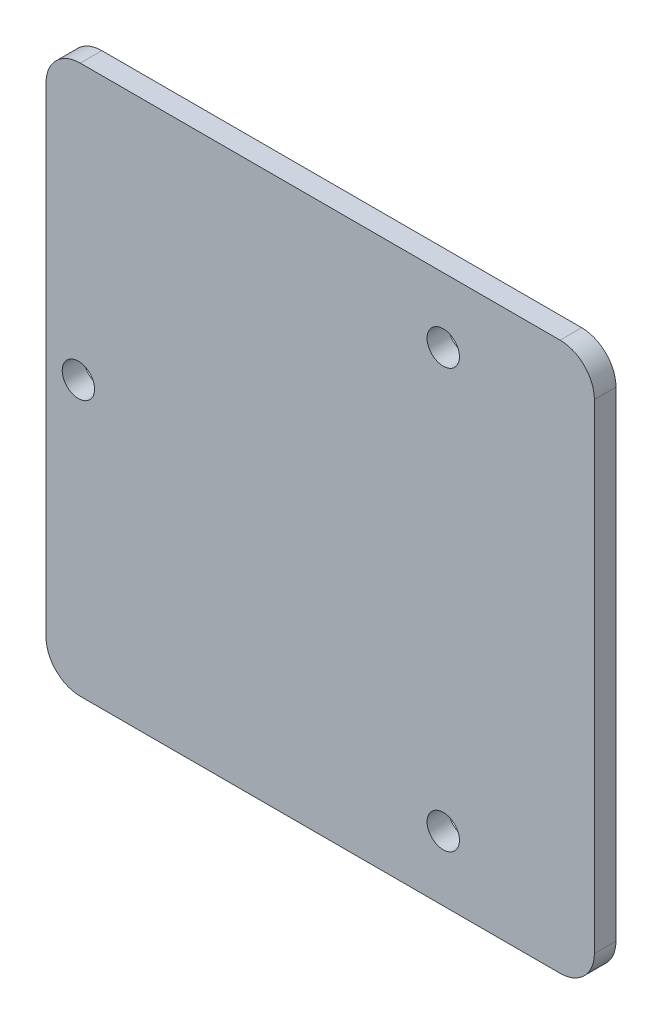
ISO-10303-21;
HEADER;
FILE_DESCRIPTION(('STEP AP214'),'2;1');
FILE_NAME('part.step','',(''),(''),'','','');
FILE_SCHEMA(('AUTOMOTIVE_DESIGN { 1 0 10303 214 1 1 1 1 }'));
ENDSEC;
DATA;
#1=APPLICATION_CONTEXT('core data for automotive mechanical design processes');
#2=APPLICATION_PROTOCOL_DEFINITION('international standard','automotive_design',2000,#1);
#3=PRODUCT_CONTEXT('',#1,'mechanical');
#4=PRODUCT('Part','Part','',(#3));
#5=PRODUCT_RELATED_PRODUCT_CATEGORY('part','',(#4));
#6=PRODUCT_DEFINITION_FORMATION('','',#4);
#7=PRODUCT_DEFINITION_CONTEXT('part definition',#1,'design');
#8=PRODUCT_DEFINITION('design','',#6,#7);
#9=PRODUCT_DEFINITION_SHAPE('','',#8);
#10=(LENGTH_UNIT() NAMED_UNIT(*) SI_UNIT(.MILLI.,.METRE.));
#11=(NAMED_UNIT(*) PLANE_ANGLE_UNIT() SI_UNIT($,.RADIAN.));
#12=(NAMED_UNIT(*) SI_UNIT($,.STERADIAN.) SOLID_ANGLE_UNIT());
#13=UNCERTAINTY_MEASURE_WITH_UNIT(LENGTH_MEASURE(1.E-05),#10,'distance_accuracy_value','');
#14=(GEOMETRIC_REPRESENTATION_CONTEXT(3) GLOBAL_UNCERTAINTY_ASSIGNED_CONTEXT((#13)) GLOBAL_UNIT_ASSIGNED_CONTEXT((#10,
#11,#12)) REPRESENTATION_CONTEXT('',''));
#15=CARTESIAN_POINT('',(0.,0.,0.));
#16=DIRECTION('',(0.,0.,1.));
#17=DIRECTION('',(1.,0.,0.));
#18=AXIS2_PLACEMENT_3D('',#15,#16,#17);
#19=CARTESIAN_POINT('',(11.4,-19.4,2.));
#20=DIRECTION('',(0.,0.,-1.));
#21=DIRECTION('',(-1.,0.,0.));
#22=AXIS2_PLACEMENT_3D('',#19,#20,#21);
#23=CYLINDRICAL_SURFACE('',#22,1.5);
#24=CARTESIAN_POINT('',(11.4,-19.4,2.));
#25=DIRECTION('',(0.,0.,-1.));
#26=DIRECTION('',(-1.,0.,0.));
#27=AXIS2_PLACEMENT_3D('',#24,#25,#26);
#28=CIRCLE('',#27,1.5);
#29=CARTESIAN_POINT('',(12.9,-19.4,2.));
#30=VERTEX_POINT('',#29);
#31=EDGE_CURVE('E39',#30,#30,#28,.T.);
#32=ORIENTED_EDGE('',*,*,#31,.F.);
#33=DIRECTION('',(0.,0.,-1.));
#34=VECTOR('',#33,1.);
#35=CARTESIAN_POINT('',(12.9,-19.4,2.));
#36=LINE('',#35,#34);
#37=CARTESIAN_POINT('',(12.9,-19.4,0.));
#38=VERTEX_POINT('',#37);
#39=EDGE_CURVE('E10',#30,#38,#36,.T.);
#40=ORIENTED_EDGE('',*,*,#39,.T.);
#41=CARTESIAN_POINT('',(11.4,-19.4,0.));
#42=DIRECTION('',(0.,0.,1.));
#43=DIRECTION('',(-1.,0.,0.));
#44=AXIS2_PLACEMENT_3D('',#41,#42,#43);
#45=CIRCLE('',#44,1.5);
#46=EDGE_CURVE('E166',#38,#38,#45,.T.);
#47=ORIENTED_EDGE('',*,*,#46,.F.);
#48=ORIENTED_EDGE('',*,*,#39,.F.);
#49=EDGE_LOOP('',(#32,#40,#47,#48));
#50=FACE_BOUND('',#49,.T.);
#51=ADVANCED_FACE('F16',(#50),#23,.F.);
#52=CARTESIAN_POINT('',(-22.4,-0.0994066505449449,2.));
#53=DIRECTION('',(0.,0.,-1.));
#54=DIRECTION('',(-1.,0.,0.));
#55=AXIS2_PLACEMENT_3D('',#52,#53,#54);
#56=CYLINDRICAL_SURFACE('',#55,1.5);
#57=CARTESIAN_POINT('',(-22.4,-0.0994066505449449,2.));
#58=DIRECTION('',(0.,0.,-1.));
#59=DIRECTION('',(-1.,0.,0.));
#60=AXIS2_PLACEMENT_3D('',#57,#58,#59);
#61=CIRCLE('',#60,1.5);
#62=CARTESIAN_POINT('',(-20.9,-0.0994066505449449,2.));
#63=VERTEX_POINT('',#62);
#64=EDGE_CURVE('E179',#63,#63,#61,.T.);
#65=ORIENTED_EDGE('',*,*,#64,.F.);
#66=DIRECTION('',(0.,0.,-1.));
#67=VECTOR('',#66,1.);
#68=CARTESIAN_POINT('',(-20.9,-0.0994066505449452,2.));
#69=LINE('',#68,#67);
#70=CARTESIAN_POINT('',(-20.9,-0.0994066505449449,0.));
#71=VERTEX_POINT('',#70);
#72=EDGE_CURVE('E20',#63,#71,#69,.T.);
#73=ORIENTED_EDGE('',*,*,#72,.T.);
#74=CARTESIAN_POINT('',(-22.4,-0.0994066505449449,0.));
#75=DIRECTION('',(0.,0.,1.));
#76=DIRECTION('',(-1.,0.,0.));
#77=AXIS2_PLACEMENT_3D('',#74,#75,#76);
#78=CIRCLE('',#77,1.5);
#79=EDGE_CURVE('E115',#71,#71,#78,.T.);
#80=ORIENTED_EDGE('',*,*,#79,.F.);
#81=ORIENTED_EDGE('',*,*,#72,.F.);
#82=EDGE_LOOP('',(#65,#73,#80,#81));
#83=FACE_BOUND('',#82,.T.);
#84=ADVANCED_FACE('F274',(#83),#56,.F.);
#85=CARTESIAN_POINT('',(11.4,19.4,2.));
#86=DIRECTION('',(0.,0.,-1.));
#87=DIRECTION('',(-1.,0.,0.));
#88=AXIS2_PLACEMENT_3D('',#85,#86,#87);
#89=CYLINDRICAL_SURFACE('',#88,1.5);
#90=CARTESIAN_POINT('',(11.4,19.4,2.));
#91=DIRECTION('',(0.,0.,-1.));
#92=DIRECTION('',(-1.,0.,0.));
#93=AXIS2_PLACEMENT_3D('',#90,#91,#92);
#94=CIRCLE('',#93,1.5);
#95=CARTESIAN_POINT('',(12.9,19.4,2.));
#96=VERTEX_POINT('',#95);
#97=EDGE_CURVE('E104',#96,#96,#94,.T.);
#98=ORIENTED_EDGE('',*,*,#97,.F.);
#99=DIRECTION('',(0.,0.,-1.));
#100=VECTOR('',#99,1.);
#101=CARTESIAN_POINT('',(12.9,19.4,2.));
#102=LINE('',#101,#100);
#103=CARTESIAN_POINT('',(12.9,19.4,0.));
#104=VERTEX_POINT('',#103);
#105=EDGE_CURVE('E232',#96,#104,#102,.T.);
#106=ORIENTED_EDGE('',*,*,#105,.T.);
#107=CARTESIAN_POINT('',(11.4,19.4,0.));
#108=DIRECTION('',(0.,0.,1.));
#109=DIRECTION('',(-1.,0.,0.));
#110=AXIS2_PLACEMENT_3D('',#107,#108,#109);
#111=CIRCLE('',#110,1.5);
#112=EDGE_CURVE('E217',#104,#104,#111,.T.);
#113=ORIENTED_EDGE('',*,*,#112,.F.);
#114=ORIENTED_EDGE('',*,*,#105,.F.);
#115=EDGE_LOOP('',(#98,#106,#113,#114));
#116=FACE_BOUND('',#115,.T.);
#117=ADVANCED_FACE('F429',(#116),#89,.F.);
#118=CARTESIAN_POINT('',(-22.225,-22.225,0.));
#119=DIRECTION('',(0.,0.,1.));
#120=DIRECTION('',(-0.707106781186547,-0.707106781186549,0.));
#121=AXIS2_PLACEMENT_3D('',#118,#119,#120);
#122=CYLINDRICAL_SURFACE('',#121,3.175);
#123=CARTESIAN_POINT('',(-22.225,-22.225,2.));
#124=DIRECTION('',(0.,0.,-1.));
#125=DIRECTION('',(-0.707106781186547,-0.707106781186549,0.));
#126=AXIS2_PLACEMENT_3D('',#123,#124,#125);
#127=CIRCLE('',#126,3.175);
#128=CARTESIAN_POINT('',(-22.225,-25.4,2.));
#129=VERTEX_POINT('',#128);
#130=CARTESIAN_POINT('',(-25.4,-22.225,2.));
#131=VERTEX_POINT('',#130);
#132=EDGE_CURVE('E229',#129,#131,#127,.T.);
#133=ORIENTED_EDGE('',*,*,#132,.T.);
#134=DIRECTION('',(0.,0.,-1.));
#135=VECTOR('',#134,1.);
#136=CARTESIAN_POINT('',(-25.4,-22.225,0.));
#137=LINE('',#136,#135);
#138=CARTESIAN_POINT('',(-25.4,-22.225,0.));
#139=VERTEX_POINT('',#138);
#140=EDGE_CURVE('E130',#131,#139,#137,.T.);
#141=ORIENTED_EDGE('',*,*,#140,.T.);
#142=CARTESIAN_POINT('',(-22.225,-22.225,0.));
#143=DIRECTION('',(0.,0.,1.));
#144=DIRECTION('',(-0.707106781186547,-0.707106781186549,0.));
#145=AXIS2_PLACEMENT_3D('',#142,#143,#144);
#146=CIRCLE('',#145,3.175);
#147=CARTESIAN_POINT('',(-22.225,-25.4,0.));
#148=VERTEX_POINT('',#147);
#149=EDGE_CURVE('E138',#139,#148,#146,.T.);
#150=ORIENTED_EDGE('',*,*,#149,.T.);
#151=DIRECTION('',(0.,0.,1.));
#152=VECTOR('',#151,1.);
#153=CARTESIAN_POINT('',(-22.225,-25.4,0.));
#154=LINE('',#153,#152);
#155=EDGE_CURVE('E145',#148,#129,#154,.T.);
#156=ORIENTED_EDGE('',*,*,#155,.T.);
#157=EDGE_LOOP('',(#133,#141,#150,#156));
#158=FACE_BOUND('',#157,.T.);
#159=ADVANCED_FACE('F155',(#158),#122,.T.);
#160=CARTESIAN_POINT('',(-25.4,25.4,0.));
#161=DIRECTION('',(-1.,0.,0.));
#162=DIRECTION('',(0.,1.,0.));
#163=AXIS2_PLACEMENT_3D('',#160,#161,#162);
#164=PLANE('',#163);
#165=ORIENTED_EDGE('',*,*,#140,.F.);
#166=DIRECTION('',(0.,-1.,0.));
#167=VECTOR('',#166,1.);
#168=CARTESIAN_POINT('',(-25.4,-25.4,2.));
#169=LINE('',#168,#167);
#170=CARTESIAN_POINT('',(-25.4,22.225,2.));
#171=VERTEX_POINT('',#170);
#172=EDGE_CURVE('E186',#171,#131,#169,.T.);
#173=ORIENTED_EDGE('',*,*,#172,.F.);
#174=DIRECTION('',(0.,0.,1.));
#175=VECTOR('',#174,1.);
#176=CARTESIAN_POINT('',(-25.4,22.225,0.));
#177=LINE('',#176,#175);
#178=CARTESIAN_POINT('',(-25.4,22.225,0.));
#179=VERTEX_POINT('',#178);
#180=EDGE_CURVE('E190',#179,#171,#177,.T.);
#181=ORIENTED_EDGE('',*,*,#180,.F.);
#182=DIRECTION('',(0.,1.,0.));
#183=VECTOR('',#182,1.);
#184=CARTESIAN_POINT('',(-25.4,-25.4,0.));
#185=LINE('',#184,#183);
#186=EDGE_CURVE('E197',#139,#179,#185,.T.);
#187=ORIENTED_EDGE('',*,*,#186,.F.);
#188=EDGE_LOOP('',(#165,#173,#181,#187));
#189=FACE_BOUND('',#188,.T.);
#190=ADVANCED_FACE('F380',(#189),#164,.T.);
#191=CARTESIAN_POINT('',(0.,0.,2.));
#192=DIRECTION('',(0.,0.,1.));
#193=DIRECTION('',(1.,0.,0.));
#194=AXIS2_PLACEMENT_3D('',#191,#192,#193);
#195=PLANE('',#194);
#196=ORIENTED_EDGE('',*,*,#132,.F.);
#197=DIRECTION('',(1.,0.,0.));
#198=VECTOR('',#197,1.);
#199=CARTESIAN_POINT('',(25.4,-25.4,2.));
#200=LINE('',#199,#198);
#201=CARTESIAN_POINT('',(22.225,-25.4,2.));
#202=VERTEX_POINT('',#201);
#203=EDGE_CURVE('E150',#129,#202,#200,.T.);
#204=ORIENTED_EDGE('',*,*,#203,.T.);
#205=CARTESIAN_POINT('',(22.225,-22.225,2.));
#206=DIRECTION('',(0.,0.,-1.));
#207=DIRECTION('',(0.707106781186548,-0.707106781186548,0.));
#208=AXIS2_PLACEMENT_3D('',#205,#206,#207);
#209=CIRCLE('',#208,3.175);
#210=CARTESIAN_POINT('',(25.4,-22.225,2.));
#211=VERTEX_POINT('',#210);
#212=EDGE_CURVE('E194',#211,#202,#209,.T.);
#213=ORIENTED_EDGE('',*,*,#212,.F.);
#214=DIRECTION('',(0.,1.,0.));
#215=VECTOR('',#214,1.);
#216=CARTESIAN_POINT('',(25.4,25.4,2.));
#217=LINE('',#216,#215);
#218=CARTESIAN_POINT('',(25.4,22.225,2.));
#219=VERTEX_POINT('',#218);
#220=EDGE_CURVE('E185',#211,#219,#217,.T.);
#221=ORIENTED_EDGE('',*,*,#220,.T.);
#222=CARTESIAN_POINT('',(22.225,22.225,2.));
#223=DIRECTION('',(0.,0.,-1.));
#224=DIRECTION('',(0.707106781186548,0.707106781186548,0.));
#225=AXIS2_PLACEMENT_3D('',#222,#223,#224);
#226=CIRCLE('',#225,3.175);
#227=CARTESIAN_POINT('',(22.225,25.4,2.));
#228=VERTEX_POINT('',#227);
#229=EDGE_CURVE('E207',#228,#219,#226,.T.);
#230=ORIENTED_EDGE('',*,*,#229,.F.);
#231=DIRECTION('',(-1.,0.,0.));
#232=VECTOR('',#231,1.);
#233=CARTESIAN_POINT('',(-25.4,25.4,2.));
#234=LINE('',#233,#232);
#235=CARTESIAN_POINT('',(-22.225,25.4,2.));
#236=VERTEX_POINT('',#235);
#237=EDGE_CURVE('E181',#228,#236,#234,.T.);
#238=ORIENTED_EDGE('',*,*,#237,.T.);
#239=CARTESIAN_POINT('',(-22.225,22.225,2.));
#240=DIRECTION('',(0.,0.,-1.));
#241=DIRECTION('',(-0.707106781186548,0.707106781186548,0.));
#242=AXIS2_PLACEMENT_3D('',#239,#240,#241);
#243=CIRCLE('',#242,3.175);
#244=EDGE_CURVE('E189',#171,#236,#243,.T.);
#245=ORIENTED_EDGE('',*,*,#244,.F.);
#246=ORIENTED_EDGE('',*,*,#172,.T.);
#247=EDGE_LOOP('',(#196,#204,#213,#221,#230,#238,#245,#246));
#248=FACE_BOUND('',#247,.T.);
#249=ORIENTED_EDGE('',*,*,#31,.T.);
#250=EDGE_LOOP('',(#249));
#251=FACE_BOUND('',#250,.T.);
#252=ORIENTED_EDGE('',*,*,#64,.T.);
#253=EDGE_LOOP('',(#252));
#254=FACE_BOUND('',#253,.T.);
#255=ORIENTED_EDGE('',*,*,#97,.T.);
#256=EDGE_LOOP('',(#255));
#257=FACE_BOUND('',#256,.T.);
#258=ADVANCED_FACE('F246',(#248,#251,#254,#257),#195,.T.);
#259=CARTESIAN_POINT('',(-22.225,22.225,0.));
#260=DIRECTION('',(0.,0.,1.));
#261=DIRECTION('',(-0.707106781186548,0.707106781186548,0.));
#262=AXIS2_PLACEMENT_3D('',#259,#260,#261);
#263=CYLINDRICAL_SURFACE('',#262,3.175);
#264=ORIENTED_EDGE('',*,*,#244,.T.);
#265=DIRECTION('',(0.,0.,-1.));
#266=VECTOR('',#265,1.);
#267=CARTESIAN_POINT('',(-22.225,25.4,0.));
#268=LINE('',#267,#266);
#269=CARTESIAN_POINT('',(-22.225,25.4,0.));
#270=VERTEX_POINT('',#269);
#271=EDGE_CURVE('E218',#236,#270,#268,.T.);
#272=ORIENTED_EDGE('',*,*,#271,.T.);
#273=CARTESIAN_POINT('',(-22.225,22.225,0.));
#274=DIRECTION('',(0.,0.,1.));
#275=DIRECTION('',(-0.707106781186548,0.707106781186548,0.));
#276=AXIS2_PLACEMENT_3D('',#273,#274,#275);
#277=CIRCLE('',#276,3.175);
#278=EDGE_CURVE('E193',#270,#179,#277,.T.);
#279=ORIENTED_EDGE('',*,*,#278,.T.);
#280=ORIENTED_EDGE('',*,*,#180,.T.);
#281=EDGE_LOOP('',(#264,#272,#279,#280));
#282=FACE_BOUND('',#281,.T.);
#283=ADVANCED_FACE('F375',(#282),#263,.T.);
#284=CARTESIAN_POINT('',(25.4,25.4,0.));
#285=DIRECTION('',(0.,1.,0.));
#286=DIRECTION('',(1.,0.,0.));
#287=AXIS2_PLACEMENT_3D('',#284,#285,#286);
#288=PLANE('',#287);
#289=ORIENTED_EDGE('',*,*,#271,.F.);
#290=ORIENTED_EDGE('',*,*,#237,.F.);
#291=DIRECTION('',(0.,0.,1.));
#292=VECTOR('',#291,1.);
#293=CARTESIAN_POINT('',(22.225,25.4,0.));
#294=LINE('',#293,#292);
#295=CARTESIAN_POINT('',(22.225,25.4,0.));
#296=VERTEX_POINT('',#295);
#297=EDGE_CURVE('E206',#296,#228,#294,.T.);
#298=ORIENTED_EDGE('',*,*,#297,.F.);
#299=DIRECTION('',(1.,0.,0.));
#300=VECTOR('',#299,1.);
#301=CARTESIAN_POINT('',(-25.4,25.4,0.));
#302=LINE('',#301,#300);
#303=EDGE_CURVE('E173',#270,#296,#302,.T.);
#304=ORIENTED_EDGE('',*,*,#303,.F.);
#305=EDGE_LOOP('',(#289,#290,#298,#304));
#306=FACE_BOUND('',#305,.T.);
#307=ADVANCED_FACE('F18',(#306),#288,.T.);
#308=CARTESIAN_POINT('',(22.225,-22.225,0.));
#309=DIRECTION('',(0.,0.,1.));
#310=DIRECTION('',(0.707106781186548,-0.707106781186548,0.));
#311=AXIS2_PLACEMENT_3D('',#308,#309,#310);
#312=CYLINDRICAL_SURFACE('',#311,3.175);
#313=ORIENTED_EDGE('',*,*,#212,.T.);
#314=DIRECTION('',(0.,0.,-1.));
#315=VECTOR('',#314,1.);
#316=CARTESIAN_POINT('',(22.225,-25.4,0.));
#317=LINE('',#316,#315);
#318=CARTESIAN_POINT('',(22.225,-25.4,0.));
#319=VERTEX_POINT('',#318);
#320=EDGE_CURVE('E214',#202,#319,#317,.T.);
#321=ORIENTED_EDGE('',*,*,#320,.T.);
#322=CARTESIAN_POINT('',(22.225,-22.225,0.));
#323=DIRECTION('',(0.,0.,1.));
#324=DIRECTION('',(0.707106781186548,-0.707106781186548,0.));
#325=AXIS2_PLACEMENT_3D('',#322,#323,#324);
#326=CIRCLE('',#325,3.175);
#327=CARTESIAN_POINT('',(25.4,-22.225,0.));
#328=VERTEX_POINT('',#327);
#329=EDGE_CURVE('E162',#319,#328,#326,.T.);
#330=ORIENTED_EDGE('',*,*,#329,.T.);
#331=DIRECTION('',(0.,0.,1.));
#332=VECTOR('',#331,1.);
#333=CARTESIAN_POINT('',(25.4,-22.225,0.));
#334=LINE('',#333,#332);
#335=EDGE_CURVE('E210',#328,#211,#334,.T.);
#336=ORIENTED_EDGE('',*,*,#335,.T.);
#337=EDGE_LOOP('',(#313,#321,#330,#336));
#338=FACE_BOUND('',#337,.T.);
#339=ADVANCED_FACE('F374',(#338),#312,.T.);
#340=CARTESIAN_POINT('',(-25.4,-25.4,0.));
#341=DIRECTION('',(0.,-1.,0.));
#342=DIRECTION('',(0.,0.,-1.));
#343=AXIS2_PLACEMENT_3D('',#340,#341,#342);
#344=PLANE('',#343);
#345=ORIENTED_EDGE('',*,*,#155,.F.);
#346=DIRECTION('',(-1.,0.,0.));
#347=VECTOR('',#346,1.);
#348=CARTESIAN_POINT('',(25.4,-25.4,0.));
#349=LINE('',#348,#347);
#350=EDGE_CURVE('E148',#319,#148,#349,.T.);
#351=ORIENTED_EDGE('',*,*,#350,.F.);
#352=ORIENTED_EDGE('',*,*,#320,.F.);
#353=ORIENTED_EDGE('',*,*,#203,.F.);
#354=EDGE_LOOP('',(#345,#351,#352,#353));
#355=FACE_BOUND('',#354,.T.);
#356=ADVANCED_FACE('F146',(#355),#344,.T.);
#357=CARTESIAN_POINT('',(22.225,22.225,0.));
#358=DIRECTION('',(0.,0.,1.));
#359=DIRECTION('',(0.707106781186548,0.707106781186548,0.));
#360=AXIS2_PLACEMENT_3D('',#357,#358,#359);
#361=CYLINDRICAL_SURFACE('',#360,3.175);
#362=ORIENTED_EDGE('',*,*,#229,.T.);
#363=DIRECTION('',(0.,0.,-1.));
#364=VECTOR('',#363,1.);
#365=CARTESIAN_POINT('',(25.4,22.225,0.));
#366=LINE('',#365,#364);
#367=CARTESIAN_POINT('',(25.4,22.225,0.));
#368=VERTEX_POINT('',#367);
#369=EDGE_CURVE('E205',#219,#368,#366,.T.);
#370=ORIENTED_EDGE('',*,*,#369,.T.);
#371=CARTESIAN_POINT('',(22.225,22.225,0.));
#372=DIRECTION('',(0.,0.,1.));
#373=DIRECTION('',(0.707106781186548,0.707106781186548,0.));
#374=AXIS2_PLACEMENT_3D('',#371,#372,#373);
#375=CIRCLE('',#374,3.175);
#376=EDGE_CURVE('E201',#368,#296,#375,.T.);
#377=ORIENTED_EDGE('',*,*,#376,.T.);
#378=ORIENTED_EDGE('',*,*,#297,.T.);
#379=EDGE_LOOP('',(#362,#370,#377,#378));
#380=FACE_BOUND('',#379,.T.);
#381=ADVANCED_FACE('F409',(#380),#361,.T.);
#382=CARTESIAN_POINT('',(25.4,-25.4,0.));
#383=DIRECTION('',(1.,0.,0.));
#384=DIRECTION('',(0.,1.,0.));
#385=AXIS2_PLACEMENT_3D('',#382,#383,#384);
#386=PLANE('',#385);
#387=ORIENTED_EDGE('',*,*,#335,.F.);
#388=DIRECTION('',(0.,-1.,0.));
#389=VECTOR('',#388,1.);
#390=CARTESIAN_POINT('',(25.4,25.4,0.));
#391=LINE('',#390,#389);
#392=EDGE_CURVE('E165',#368,#328,#391,.T.);
#393=ORIENTED_EDGE('',*,*,#392,.F.);
#394=ORIENTED_EDGE('',*,*,#369,.F.);
#395=ORIENTED_EDGE('',*,*,#220,.F.);
#396=EDGE_LOOP('',(#387,#393,#394,#395));
#397=FACE_BOUND('',#396,.T.);
#398=ADVANCED_FACE('F413',(#397),#386,.T.);
#399=CARTESIAN_POINT('',(0.,0.,0.));
#400=DIRECTION('',(0.,0.,1.));
#401=DIRECTION('',(1.,0.,0.));
#402=AXIS2_PLACEMENT_3D('',#399,#400,#401);
#403=PLANE('',#402);
#404=ORIENTED_EDGE('',*,*,#149,.F.);
#405=ORIENTED_EDGE('',*,*,#186,.T.);
#406=ORIENTED_EDGE('',*,*,#278,.F.);
#407=ORIENTED_EDGE('',*,*,#303,.T.);
#408=ORIENTED_EDGE('',*,*,#376,.F.);
#409=ORIENTED_EDGE('',*,*,#392,.T.);
#410=ORIENTED_EDGE('',*,*,#329,.F.);
#411=ORIENTED_EDGE('',*,*,#350,.T.);
#412=EDGE_LOOP('',(#404,#405,#406,#407,#408,#409,#410,#411));
#413=FACE_BOUND('',#412,.T.);
#414=ORIENTED_EDGE('',*,*,#46,.T.);
#415=EDGE_LOOP('',(#414));
#416=FACE_BOUND('',#415,.T.);
#417=ORIENTED_EDGE('',*,*,#79,.T.);
#418=EDGE_LOOP('',(#417));
#419=FACE_BOUND('',#418,.T.);
#420=ORIENTED_EDGE('',*,*,#112,.T.);
#421=EDGE_LOOP('',(#420));
#422=FACE_BOUND('',#421,.T.);
#423=ADVANCED_FACE('F158',(#413,#416,#419,#422),#403,.F.);
#424=CLOSED_SHELL('',(#51,#84,#117,#159,#190,#258,#283,#307,#339,#356,#381,#398,#423));
#425=MANIFOLD_SOLID_BREP('B1',#424);
#426=ADVANCED_BREP_SHAPE_REPRESENTATION('',(#18,#425),#14);
#427=SHAPE_DEFINITION_REPRESENTATION(#9,#426);
ENDSEC;
END-ISO-10303-21;
